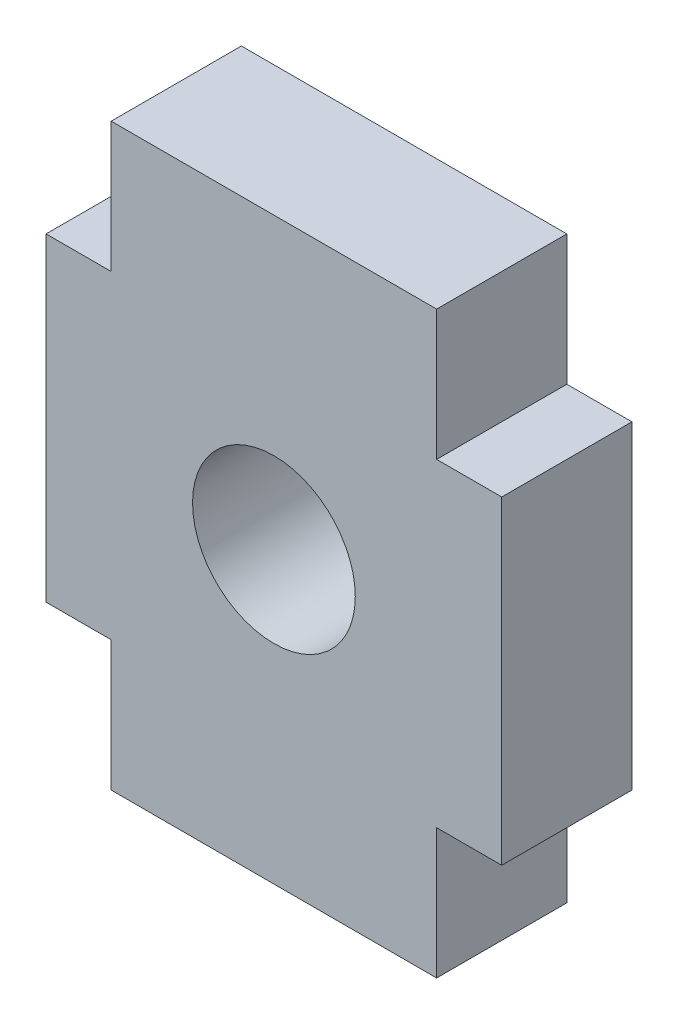
ISO-10303-21;
HEADER;
FILE_DESCRIPTION(('STEP AP214'),'2;1');
FILE_NAME('part.step','',(''),(''),'','','');
FILE_SCHEMA(('AUTOMOTIVE_DESIGN { 1 0 10303 214 1 1 1 1 }'));
ENDSEC;
DATA;
#1=APPLICATION_CONTEXT('core data for automotive mechanical design processes');
#2=APPLICATION_PROTOCOL_DEFINITION('international standard','automotive_design',2000,#1);
#3=PRODUCT_CONTEXT('',#1,'mechanical');
#4=PRODUCT('Part','Part','',(#3));
#5=PRODUCT_RELATED_PRODUCT_CATEGORY('part','',(#4));
#6=PRODUCT_DEFINITION_FORMATION('','',#4);
#7=PRODUCT_DEFINITION_CONTEXT('part definition',#1,'design');
#8=PRODUCT_DEFINITION('design','',#6,#7);
#9=PRODUCT_DEFINITION_SHAPE('','',#8);
#10=(LENGTH_UNIT() NAMED_UNIT(*) SI_UNIT(.MILLI.,.METRE.));
#11=(NAMED_UNIT(*) PLANE_ANGLE_UNIT() SI_UNIT($,.RADIAN.));
#12=(NAMED_UNIT(*) SI_UNIT($,.STERADIAN.) SOLID_ANGLE_UNIT());
#13=UNCERTAINTY_MEASURE_WITH_UNIT(LENGTH_MEASURE(1.E-05),#10,'distance_accuracy_value','');
#14=(GEOMETRIC_REPRESENTATION_CONTEXT(3) GLOBAL_UNCERTAINTY_ASSIGNED_CONTEXT((#13)) GLOBAL_UNIT_ASSIGNED_CONTEXT((#10,
#11,#12)) REPRESENTATION_CONTEXT('',''));
#15=CARTESIAN_POINT('',(0.,0.,0.));
#16=DIRECTION('',(0.,0.,1.));
#17=DIRECTION('',(1.,0.,0.));
#18=AXIS2_PLACEMENT_3D('',#15,#16,#17);
#19=CARTESIAN_POINT('',(0.,0.,2.));
#20=DIRECTION('',(0.,0.,-1.));
#21=DIRECTION('',(-1.,0.,0.));
#22=AXIS2_PLACEMENT_3D('',#19,#20,#21);
#23=PLANE('',#22);
#24=DIRECTION('',(0.,1.,0.));
#25=VECTOR('',#24,1.);
#26=CARTESIAN_POINT('',(1957.17680872112,1463.78411595094,2.));
#27=LINE('',#26,#25);
#28=CARTESIAN_POINT('',(1957.17680872112,1463.78411595094,2.));
#29=VERTEX_POINT('',#28);
#30=CARTESIAN_POINT('',(1957.17680872112,1465.78411595094,2.));
#31=VERTEX_POINT('',#30);
#32=EDGE_CURVE('E176',#29,#31,#27,.T.);
#33=ORIENTED_EDGE('',*,*,#32,.T.);
#34=DIRECTION('',(-1.,0.,0.));
#35=VECTOR('',#34,1.);
#36=CARTESIAN_POINT('',(1952.17680872112,1465.78411595094,2.));
#37=LINE('',#36,#35);
#38=CARTESIAN_POINT('',(1952.17680872112,1465.78411595094,2.));
#39=VERTEX_POINT('',#38);
#40=EDGE_CURVE('E104',#31,#39,#37,.T.);
#41=ORIENTED_EDGE('',*,*,#40,.T.);
#42=DIRECTION('',(0.,-1.,0.));
#43=VECTOR('',#42,1.);
#44=CARTESIAN_POINT('',(1952.17680872112,1463.78411595094,2.));
#45=LINE('',#44,#43);
#46=CARTESIAN_POINT('',(1952.17680872112,1463.78411595094,2.));
#47=VERTEX_POINT('',#46);
#48=EDGE_CURVE('E203',#39,#47,#45,.T.);
#49=ORIENTED_EDGE('',*,*,#48,.T.);
#50=DIRECTION('',(-1.,0.,0.));
#51=VECTOR('',#50,1.);
#52=CARTESIAN_POINT('',(1952.17680872112,1463.78411595094,2.));
#53=LINE('',#52,#51);
#54=CARTESIAN_POINT('',(1951.17680872112,1463.78411595094,2.));
#55=VERTEX_POINT('',#54);
#56=EDGE_CURVE('E222',#47,#55,#53,.T.);
#57=ORIENTED_EDGE('',*,*,#56,.T.);
#58=DIRECTION('',(0.,-1.,0.));
#59=VECTOR('',#58,1.);
#60=CARTESIAN_POINT('',(1951.17680872112,1463.78411595094,2.));
#61=LINE('',#60,#59);
#62=CARTESIAN_POINT('',(1951.17680872112,1458.88411595094,2.));
#63=VERTEX_POINT('',#62);
#64=EDGE_CURVE('E219',#55,#63,#61,.T.);
#65=ORIENTED_EDGE('',*,*,#64,.T.);
#66=DIRECTION('',(1.,0.,0.));
#67=VECTOR('',#66,1.);
#68=CARTESIAN_POINT('',(1952.17680872112,1458.88411595094,2.));
#69=LINE('',#68,#67);
#70=CARTESIAN_POINT('',(1952.17680872112,1458.88411595094,2.));
#71=VERTEX_POINT('',#70);
#72=EDGE_CURVE('E221',#63,#71,#69,.T.);
#73=ORIENTED_EDGE('',*,*,#72,.T.);
#74=DIRECTION('',(-2.22044604925056E-13,-1.,0.));
#75=VECTOR('',#74,1.);
#76=CARTESIAN_POINT('',(1952.17680872112,1458.88411595094,2.));
#77=LINE('',#76,#75);
#78=CARTESIAN_POINT('',(1952.17680872112,1456.88411595094,2.));
#79=VERTEX_POINT('',#78);
#80=EDGE_CURVE('E224',#71,#79,#77,.T.);
#81=ORIENTED_EDGE('',*,*,#80,.T.);
#82=DIRECTION('',(1.,0.,0.));
#83=VECTOR('',#82,1.);
#84=CARTESIAN_POINT('',(1952.17680872112,1456.88411595094,2.));
#85=LINE('',#84,#83);
#86=CARTESIAN_POINT('',(1957.17680872112,1456.88411595094,2.));
#87=VERTEX_POINT('',#86);
#88=EDGE_CURVE('E230',#79,#87,#85,.T.);
#89=ORIENTED_EDGE('',*,*,#88,.T.);
#90=DIRECTION('',(0.,1.,0.));
#91=VECTOR('',#90,1.);
#92=CARTESIAN_POINT('',(1957.17680872112,1458.88411595094,2.));
#93=LINE('',#92,#91);
#94=CARTESIAN_POINT('',(1957.17680872112,1458.88411595094,2.));
#95=VERTEX_POINT('',#94);
#96=EDGE_CURVE('E135',#87,#95,#93,.T.);
#97=ORIENTED_EDGE('',*,*,#96,.T.);
#98=DIRECTION('',(1.,0.,0.));
#99=VECTOR('',#98,1.);
#100=CARTESIAN_POINT('',(1957.17680872112,1458.88411595094,2.));
#101=LINE('',#100,#99);
#102=CARTESIAN_POINT('',(1958.17680872112,1458.88411595094,2.));
#103=VERTEX_POINT('',#102);
#104=EDGE_CURVE('E129',#95,#103,#101,.T.);
#105=ORIENTED_EDGE('',*,*,#104,.T.);
#106=DIRECTION('',(0.,1.,0.));
#107=VECTOR('',#106,1.);
#108=CARTESIAN_POINT('',(1958.17680872112,1463.78411595094,2.));
#109=LINE('',#108,#107);
#110=CARTESIAN_POINT('',(1958.17680872112,1463.78411595094,2.));
#111=VERTEX_POINT('',#110);
#112=EDGE_CURVE('E133',#103,#111,#109,.T.);
#113=ORIENTED_EDGE('',*,*,#112,.T.);
#114=DIRECTION('',(-1.,0.,0.));
#115=VECTOR('',#114,1.);
#116=CARTESIAN_POINT('',(1957.17680872112,1463.78411595094,2.));
#117=LINE('',#116,#115);
#118=EDGE_CURVE('E49',#111,#29,#117,.T.);
#119=ORIENTED_EDGE('',*,*,#118,.T.);
#120=EDGE_LOOP('',(#33,#41,#49,#57,#65,#73,#81,#89,#97,#105,#113,#119));
#121=FACE_BOUND('',#120,.T.);
#122=CARTESIAN_POINT('',(1954.67680872112,1461.33411595094,2.));
#123=DIRECTION('',(0.,0.,1.));
#124=DIRECTION('',(1.,0.,0.));
#125=AXIS2_PLACEMENT_3D('',#122,#123,#124);
#126=CIRCLE('',#125,1.25000000000008);
#127=CARTESIAN_POINT('',(1955.92680872112,1461.33411595094,2.));
#128=VERTEX_POINT('',#127);
#129=EDGE_CURVE('E157',#128,#128,#126,.T.);
#130=ORIENTED_EDGE('',*,*,#129,.F.);
#131=EDGE_LOOP('',(#130));
#132=FACE_BOUND('',#131,.T.);
#133=ADVANCED_FACE('F32',(#121,#132),#23,.F.);
#134=CARTESIAN_POINT('',(0.,0.,0.));
#135=DIRECTION('',(0.,0.,-1.));
#136=DIRECTION('',(-1.,0.,0.));
#137=AXIS2_PLACEMENT_3D('',#134,#135,#136);
#138=PLANE('',#137);
#139=DIRECTION('',(0.,1.,0.));
#140=VECTOR('',#139,1.);
#141=CARTESIAN_POINT('',(1957.17680872112,1463.78411595094,0.));
#142=LINE('',#141,#140);
#143=CARTESIAN_POINT('',(1957.17680872112,1463.78411595094,0.));
#144=VERTEX_POINT('',#143);
#145=CARTESIAN_POINT('',(1957.17680872112,1465.78411595094,0.));
#146=VERTEX_POINT('',#145);
#147=EDGE_CURVE('E153',#144,#146,#142,.T.);
#148=ORIENTED_EDGE('',*,*,#147,.F.);
#149=DIRECTION('',(-1.,0.,0.));
#150=VECTOR('',#149,1.);
#151=CARTESIAN_POINT('',(1957.17680872112,1463.78411595094,0.));
#152=LINE('',#151,#150);
#153=CARTESIAN_POINT('',(1958.17680872112,1463.78411595094,0.));
#154=VERTEX_POINT('',#153);
#155=EDGE_CURVE('E96',#154,#144,#152,.T.);
#156=ORIENTED_EDGE('',*,*,#155,.F.);
#157=DIRECTION('',(0.,1.,0.));
#158=VECTOR('',#157,1.);
#159=CARTESIAN_POINT('',(1958.17680872112,1463.78411595094,0.));
#160=LINE('',#159,#158);
#161=CARTESIAN_POINT('',(1958.17680872112,1458.88411595094,0.));
#162=VERTEX_POINT('',#161);
#163=EDGE_CURVE('E90',#162,#154,#160,.T.);
#164=ORIENTED_EDGE('',*,*,#163,.F.);
#165=DIRECTION('',(1.,0.,0.));
#166=VECTOR('',#165,1.);
#167=CARTESIAN_POINT('',(1957.17680872112,1458.88411595094,0.));
#168=LINE('',#167,#166);
#169=CARTESIAN_POINT('',(1957.17680872112,1458.88411595094,0.));
#170=VERTEX_POINT('',#169);
#171=EDGE_CURVE('E143',#170,#162,#168,.T.);
#172=ORIENTED_EDGE('',*,*,#171,.F.);
#173=DIRECTION('',(0.,1.,0.));
#174=VECTOR('',#173,1.);
#175=CARTESIAN_POINT('',(1957.17680872112,1458.88411595094,0.));
#176=LINE('',#175,#174);
#177=CARTESIAN_POINT('',(1957.17680872112,1456.88411595094,0.));
#178=VERTEX_POINT('',#177);
#179=EDGE_CURVE('E171',#178,#170,#176,.T.);
#180=ORIENTED_EDGE('',*,*,#179,.F.);
#181=DIRECTION('',(1.,0.,0.));
#182=VECTOR('',#181,1.);
#183=CARTESIAN_POINT('',(1952.17680872112,1456.88411595094,0.));
#184=LINE('',#183,#182);
#185=CARTESIAN_POINT('',(1952.17680872112,1456.88411595094,0.));
#186=VERTEX_POINT('',#185);
#187=EDGE_CURVE('E169',#186,#178,#184,.T.);
#188=ORIENTED_EDGE('',*,*,#187,.F.);
#189=DIRECTION('',(-2.22044604925056E-13,-1.,0.));
#190=VECTOR('',#189,1.);
#191=CARTESIAN_POINT('',(1952.17680872112,1458.88411595094,0.));
#192=LINE('',#191,#190);
#193=CARTESIAN_POINT('',(1952.17680872112,1458.88411595094,0.));
#194=VERTEX_POINT('',#193);
#195=EDGE_CURVE('E167',#194,#186,#192,.T.);
#196=ORIENTED_EDGE('',*,*,#195,.F.);
#197=DIRECTION('',(1.,0.,0.));
#198=VECTOR('',#197,1.);
#199=CARTESIAN_POINT('',(1952.17680872112,1458.88411595094,0.));
#200=LINE('',#199,#198);
#201=CARTESIAN_POINT('',(1951.17680872112,1458.88411595094,0.));
#202=VERTEX_POINT('',#201);
#203=EDGE_CURVE('E165',#202,#194,#200,.T.);
#204=ORIENTED_EDGE('',*,*,#203,.F.);
#205=DIRECTION('',(0.,-1.,0.));
#206=VECTOR('',#205,1.);
#207=CARTESIAN_POINT('',(1951.17680872112,1463.78411595094,0.));
#208=LINE('',#207,#206);
#209=CARTESIAN_POINT('',(1951.17680872112,1463.78411595094,0.));
#210=VERTEX_POINT('',#209);
#211=EDGE_CURVE('E163',#210,#202,#208,.T.);
#212=ORIENTED_EDGE('',*,*,#211,.F.);
#213=DIRECTION('',(-1.,0.,0.));
#214=VECTOR('',#213,1.);
#215=CARTESIAN_POINT('',(1952.17680872112,1463.78411595094,0.));
#216=LINE('',#215,#214);
#217=CARTESIAN_POINT('',(1952.17680872112,1463.78411595094,0.));
#218=VERTEX_POINT('',#217);
#219=EDGE_CURVE('E161',#218,#210,#216,.T.);
#220=ORIENTED_EDGE('',*,*,#219,.F.);
#221=DIRECTION('',(0.,-1.,0.));
#222=VECTOR('',#221,1.);
#223=CARTESIAN_POINT('',(1952.17680872112,1463.78411595094,0.));
#224=LINE('',#223,#222);
#225=CARTESIAN_POINT('',(1952.17680872112,1465.78411595094,0.));
#226=VERTEX_POINT('',#225);
#227=EDGE_CURVE('E159',#226,#218,#224,.T.);
#228=ORIENTED_EDGE('',*,*,#227,.F.);
#229=DIRECTION('',(-1.,0.,0.));
#230=VECTOR('',#229,1.);
#231=CARTESIAN_POINT('',(1952.17680872112,1465.78411595094,0.));
#232=LINE('',#231,#230);
#233=EDGE_CURVE('E156',#146,#226,#232,.T.);
#234=ORIENTED_EDGE('',*,*,#233,.F.);
#235=EDGE_LOOP('',(#148,#156,#164,#172,#180,#188,#196,#204,#212,#220,#228,#234));
#236=FACE_BOUND('',#235,.T.);
#237=CARTESIAN_POINT('',(1954.67680872112,1461.33411595094,0.));
#238=DIRECTION('',(0.,0.,1.));
#239=DIRECTION('',(1.,0.,0.));
#240=AXIS2_PLACEMENT_3D('',#237,#238,#239);
#241=CIRCLE('',#240,1.25000000000008);
#242=CARTESIAN_POINT('',(1955.92680872112,1461.33411595094,0.));
#243=VERTEX_POINT('',#242);
#244=EDGE_CURVE('E377',#243,#243,#241,.T.);
#245=ORIENTED_EDGE('',*,*,#244,.T.);
#246=EDGE_LOOP('',(#245));
#247=FACE_BOUND('',#246,.T.);
#248=ADVANCED_FACE('F207',(#236,#247),#138,.T.);
#249=CARTESIAN_POINT('',(1957.17680872112,1463.78411595094,2.));
#250=DIRECTION('',(-1.,0.,0.));
#251=DIRECTION('',(0.,0.,1.));
#252=AXIS2_PLACEMENT_3D('',#249,#250,#251);
#253=PLANE('',#252);
#254=ORIENTED_EDGE('',*,*,#147,.T.);
#255=DIRECTION('',(0.,0.,-1.));
#256=VECTOR('',#255,1.);
#257=CARTESIAN_POINT('',(1957.17680872112,1465.78411595094,2.));
#258=LINE('',#257,#256);
#259=EDGE_CURVE('E11',#31,#146,#258,.T.);
#260=ORIENTED_EDGE('',*,*,#259,.F.);
#261=ORIENTED_EDGE('',*,*,#32,.F.);
#262=DIRECTION('',(0.,0.,-1.));
#263=VECTOR('',#262,1.);
#264=CARTESIAN_POINT('',(1957.17680872112,1463.78411595094,2.));
#265=LINE('',#264,#263);
#266=EDGE_CURVE('E149',#29,#144,#265,.T.);
#267=ORIENTED_EDGE('',*,*,#266,.T.);
#268=EDGE_LOOP('',(#254,#260,#261,#267));
#269=FACE_BOUND('',#268,.T.);
#270=ADVANCED_FACE('F34',(#269),#253,.F.);
#271=CARTESIAN_POINT('',(1952.17680872112,1465.78411595094,2.));
#272=DIRECTION('',(0.,-1.,0.));
#273=DIRECTION('',(0.,0.,-1.));
#274=AXIS2_PLACEMENT_3D('',#271,#272,#273);
#275=PLANE('',#274);
#276=ORIENTED_EDGE('',*,*,#233,.T.);
#277=DIRECTION('',(0.,0.,-1.));
#278=VECTOR('',#277,1.);
#279=CARTESIAN_POINT('',(1952.17680872112,1465.78411595094,2.));
#280=LINE('',#279,#278);
#281=EDGE_CURVE('E41',#39,#226,#280,.T.);
#282=ORIENTED_EDGE('',*,*,#281,.F.);
#283=ORIENTED_EDGE('',*,*,#40,.F.);
#284=ORIENTED_EDGE('',*,*,#259,.T.);
#285=EDGE_LOOP('',(#276,#282,#283,#284));
#286=FACE_BOUND('',#285,.T.);
#287=ADVANCED_FACE('F264',(#286),#275,.F.);
#288=CARTESIAN_POINT('',(1952.17680872112,1463.78411595094,2.));
#289=DIRECTION('',(1.,0.,0.));
#290=DIRECTION('',(0.,0.,-1.));
#291=AXIS2_PLACEMENT_3D('',#288,#289,#290);
#292=PLANE('',#291);
#293=ORIENTED_EDGE('',*,*,#227,.T.);
#294=DIRECTION('',(0.,0.,-1.));
#295=VECTOR('',#294,1.);
#296=CARTESIAN_POINT('',(1952.17680872112,1463.78411595094,2.));
#297=LINE('',#296,#295);
#298=EDGE_CURVE('E195',#47,#218,#297,.T.);
#299=ORIENTED_EDGE('',*,*,#298,.F.);
#300=ORIENTED_EDGE('',*,*,#48,.F.);
#301=ORIENTED_EDGE('',*,*,#281,.T.);
#302=EDGE_LOOP('',(#293,#299,#300,#301));
#303=FACE_BOUND('',#302,.T.);
#304=ADVANCED_FACE('F201',(#303),#292,.F.);
#305=CARTESIAN_POINT('',(1952.17680872112,1463.78411595094,2.));
#306=DIRECTION('',(0.,-1.,0.));
#307=DIRECTION('',(0.,0.,-1.));
#308=AXIS2_PLACEMENT_3D('',#305,#306,#307);
#309=PLANE('',#308);
#310=ORIENTED_EDGE('',*,*,#219,.T.);
#311=DIRECTION('',(0.,0.,-1.));
#312=VECTOR('',#311,1.);
#313=CARTESIAN_POINT('',(1951.17680872112,1463.78411595094,2.));
#314=LINE('',#313,#312);
#315=EDGE_CURVE('E192',#55,#210,#314,.T.);
#316=ORIENTED_EDGE('',*,*,#315,.F.);
#317=ORIENTED_EDGE('',*,*,#56,.F.);
#318=ORIENTED_EDGE('',*,*,#298,.T.);
#319=EDGE_LOOP('',(#310,#316,#317,#318));
#320=FACE_BOUND('',#319,.T.);
#321=ADVANCED_FACE('F213',(#320),#309,.F.);
#322=CARTESIAN_POINT('',(1951.17680872112,1463.78411595094,2.));
#323=DIRECTION('',(1.,0.,0.));
#324=DIRECTION('',(0.,0.,-1.));
#325=AXIS2_PLACEMENT_3D('',#322,#323,#324);
#326=PLANE('',#325);
#327=ORIENTED_EDGE('',*,*,#211,.T.);
#328=DIRECTION('',(0.,0.,-1.));
#329=VECTOR('',#328,1.);
#330=CARTESIAN_POINT('',(1951.17680872112,1458.88411595094,2.));
#331=LINE('',#330,#329);
#332=EDGE_CURVE('E189',#63,#202,#331,.T.);
#333=ORIENTED_EDGE('',*,*,#332,.F.);
#334=ORIENTED_EDGE('',*,*,#64,.F.);
#335=ORIENTED_EDGE('',*,*,#315,.T.);
#336=EDGE_LOOP('',(#327,#333,#334,#335));
#337=FACE_BOUND('',#336,.T.);
#338=ADVANCED_FACE('F217',(#337),#326,.F.);
#339=CARTESIAN_POINT('',(1952.17680872112,1458.88411595094,2.));
#340=DIRECTION('',(0.,1.,0.));
#341=DIRECTION('',(0.,0.,1.));
#342=AXIS2_PLACEMENT_3D('',#339,#340,#341);
#343=PLANE('',#342);
#344=ORIENTED_EDGE('',*,*,#203,.T.);
#345=DIRECTION('',(0.,0.,-1.));
#346=VECTOR('',#345,1.);
#347=CARTESIAN_POINT('',(1952.17680872112,1458.88411595094,2.));
#348=LINE('',#347,#346);
#349=EDGE_CURVE('E186',#71,#194,#348,.T.);
#350=ORIENTED_EDGE('',*,*,#349,.F.);
#351=ORIENTED_EDGE('',*,*,#72,.F.);
#352=ORIENTED_EDGE('',*,*,#332,.T.);
#353=EDGE_LOOP('',(#344,#350,#351,#352));
#354=FACE_BOUND('',#353,.T.);
#355=ADVANCED_FACE('F277',(#354),#343,.F.);
#356=CARTESIAN_POINT('',(1952.17680872112,1458.88411595094,2.));
#357=DIRECTION('',(1.,-2.22044604925056E-13,0.));
#358=DIRECTION('',(2.22044604925056E-13,1.,0.));
#359=AXIS2_PLACEMENT_3D('',#356,#357,#358);
#360=PLANE('',#359);
#361=ORIENTED_EDGE('',*,*,#195,.T.);
#362=DIRECTION('',(0.,0.,-1.));
#363=VECTOR('',#362,1.);
#364=CARTESIAN_POINT('',(1952.17680872112,1456.88411595094,2.));
#365=LINE('',#364,#363);
#366=EDGE_CURVE('E183',#79,#186,#365,.T.);
#367=ORIENTED_EDGE('',*,*,#366,.F.);
#368=ORIENTED_EDGE('',*,*,#80,.F.);
#369=ORIENTED_EDGE('',*,*,#349,.T.);
#370=EDGE_LOOP('',(#361,#367,#368,#369));
#371=FACE_BOUND('',#370,.T.);
#372=ADVANCED_FACE('F280',(#371),#360,.F.);
#373=CARTESIAN_POINT('',(1952.17680872112,1456.88411595094,2.));
#374=DIRECTION('',(0.,1.,0.));
#375=DIRECTION('',(0.,0.,1.));
#376=AXIS2_PLACEMENT_3D('',#373,#374,#375);
#377=PLANE('',#376);
#378=ORIENTED_EDGE('',*,*,#187,.T.);
#379=DIRECTION('',(0.,0.,-1.));
#380=VECTOR('',#379,1.);
#381=CARTESIAN_POINT('',(1957.17680872112,1456.88411595094,2.));
#382=LINE('',#381,#380);
#383=EDGE_CURVE('E180',#87,#178,#382,.T.);
#384=ORIENTED_EDGE('',*,*,#383,.F.);
#385=ORIENTED_EDGE('',*,*,#88,.F.);
#386=ORIENTED_EDGE('',*,*,#366,.T.);
#387=EDGE_LOOP('',(#378,#384,#385,#386));
#388=FACE_BOUND('',#387,.T.);
#389=ADVANCED_FACE('F236',(#388),#377,.F.);
#390=CARTESIAN_POINT('',(1957.17680872112,1458.88411595094,2.));
#391=DIRECTION('',(-1.,0.,0.));
#392=DIRECTION('',(0.,0.,1.));
#393=AXIS2_PLACEMENT_3D('',#390,#391,#392);
#394=PLANE('',#393);
#395=ORIENTED_EDGE('',*,*,#179,.T.);
#396=DIRECTION('',(0.,0.,-1.));
#397=VECTOR('',#396,1.);
#398=CARTESIAN_POINT('',(1957.17680872112,1458.88411595094,2.));
#399=LINE('',#398,#397);
#400=EDGE_CURVE('E144',#95,#170,#399,.T.);
#401=ORIENTED_EDGE('',*,*,#400,.F.);
#402=ORIENTED_EDGE('',*,*,#96,.F.);
#403=ORIENTED_EDGE('',*,*,#383,.T.);
#404=EDGE_LOOP('',(#395,#401,#402,#403));
#405=FACE_BOUND('',#404,.T.);
#406=ADVANCED_FACE('F240',(#405),#394,.F.);
#407=CARTESIAN_POINT('',(1957.17680872112,1458.88411595094,2.));
#408=DIRECTION('',(0.,1.,0.));
#409=DIRECTION('',(0.,0.,1.));
#410=AXIS2_PLACEMENT_3D('',#407,#408,#409);
#411=PLANE('',#410);
#412=ORIENTED_EDGE('',*,*,#171,.T.);
#413=DIRECTION('',(0.,0.,-1.));
#414=VECTOR('',#413,1.);
#415=CARTESIAN_POINT('',(1958.17680872112,1458.88411595094,2.));
#416=LINE('',#415,#414);
#417=EDGE_CURVE('E140',#103,#162,#416,.T.);
#418=ORIENTED_EDGE('',*,*,#417,.F.);
#419=ORIENTED_EDGE('',*,*,#104,.F.);
#420=ORIENTED_EDGE('',*,*,#400,.T.);
#421=EDGE_LOOP('',(#412,#418,#419,#420));
#422=FACE_BOUND('',#421,.T.);
#423=ADVANCED_FACE('F141',(#422),#411,.F.);
#424=CARTESIAN_POINT('',(1958.17680872112,1463.78411595094,2.));
#425=DIRECTION('',(-1.,0.,0.));
#426=DIRECTION('',(0.,0.,1.));
#427=AXIS2_PLACEMENT_3D('',#424,#425,#426);
#428=PLANE('',#427);
#429=ORIENTED_EDGE('',*,*,#163,.T.);
#430=DIRECTION('',(0.,0.,-1.));
#431=VECTOR('',#430,1.);
#432=CARTESIAN_POINT('',(1958.17680872112,1463.78411595094,2.));
#433=LINE('',#432,#431);
#434=EDGE_CURVE('E145',#111,#154,#433,.T.);
#435=ORIENTED_EDGE('',*,*,#434,.F.);
#436=ORIENTED_EDGE('',*,*,#112,.F.);
#437=ORIENTED_EDGE('',*,*,#417,.T.);
#438=EDGE_LOOP('',(#429,#435,#436,#437));
#439=FACE_BOUND('',#438,.T.);
#440=ADVANCED_FACE('F147',(#439),#428,.F.);
#441=CARTESIAN_POINT('',(1957.17680872112,1463.78411595094,2.));
#442=DIRECTION('',(0.,-1.,0.));
#443=DIRECTION('',(0.,0.,-1.));
#444=AXIS2_PLACEMENT_3D('',#441,#442,#443);
#445=PLANE('',#444);
#446=ORIENTED_EDGE('',*,*,#155,.T.);
#447=ORIENTED_EDGE('',*,*,#266,.F.);
#448=ORIENTED_EDGE('',*,*,#118,.F.);
#449=ORIENTED_EDGE('',*,*,#434,.T.);
#450=EDGE_LOOP('',(#446,#447,#448,#449));
#451=FACE_BOUND('',#450,.T.);
#452=ADVANCED_FACE('F244',(#451),#445,.F.);
#453=CARTESIAN_POINT('',(1954.67680872112,1461.33411595094,2.));
#454=DIRECTION('',(0.,0.,-1.));
#455=DIRECTION('',(-1.,0.,0.));
#456=AXIS2_PLACEMENT_3D('',#453,#454,#455);
#457=CYLINDRICAL_SURFACE('',#456,1.25000000000008);
#458=ORIENTED_EDGE('',*,*,#129,.T.);
#459=EDGE_LOOP('',(#458));
#460=FACE_BOUND('',#459,.T.);
#461=ORIENTED_EDGE('',*,*,#244,.F.);
#462=EDGE_LOOP('',(#461));
#463=FACE_BOUND('',#462,.T.);
#464=ADVANCED_FACE('F246',(#460,#463),#457,.F.);
#465=CLOSED_SHELL('',(#133,#248,#270,#287,#304,#321,#338,#355,#372,#389,#406,#423,#440,#452,#464));
#466=MANIFOLD_SOLID_BREP('B2',#465);
#467=ADVANCED_BREP_SHAPE_REPRESENTATION('',(#18,#466),#14);
#468=SHAPE_DEFINITION_REPRESENTATION(#9,#467);
ENDSEC;
END-ISO-10303-21;
